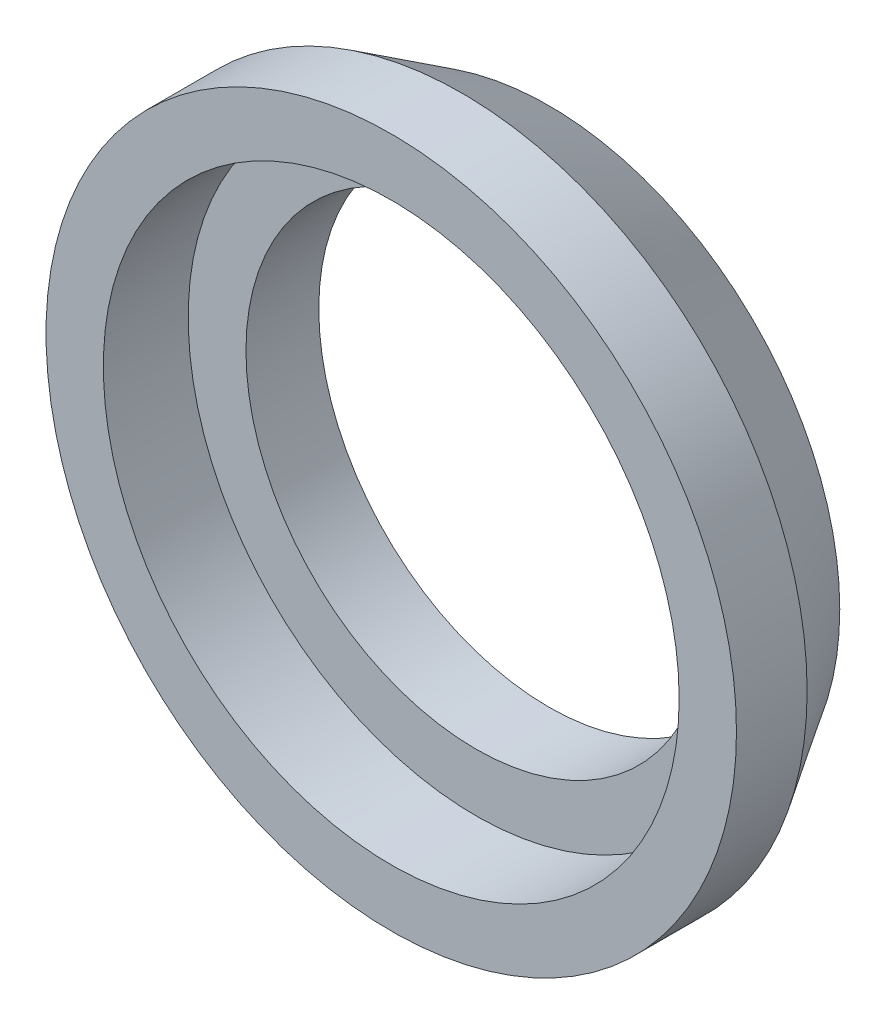
ISO-10303-21;
HEADER;
FILE_DESCRIPTION(('STEP AP214'),'2;1');
FILE_NAME('part.step','',(''),(''),'','','');
FILE_SCHEMA(('AUTOMOTIVE_DESIGN { 1 0 10303 214 1 1 1 1 }'));
ENDSEC;
DATA;
#1=APPLICATION_CONTEXT('core data for automotive mechanical design processes');
#2=APPLICATION_PROTOCOL_DEFINITION('international standard','automotive_design',2000,#1);
#3=PRODUCT_CONTEXT('',#1,'mechanical');
#4=PRODUCT('Part','Part','',(#3));
#5=PRODUCT_RELATED_PRODUCT_CATEGORY('part','',(#4));
#6=PRODUCT_DEFINITION_FORMATION('','',#4);
#7=PRODUCT_DEFINITION_CONTEXT('part definition',#1,'design');
#8=PRODUCT_DEFINITION('design','',#6,#7);
#9=PRODUCT_DEFINITION_SHAPE('','',#8);
#10=(LENGTH_UNIT() NAMED_UNIT(*) SI_UNIT(.MILLI.,.METRE.));
#11=(NAMED_UNIT(*) PLANE_ANGLE_UNIT() SI_UNIT($,.RADIAN.));
#12=(NAMED_UNIT(*) SI_UNIT($,.STERADIAN.) SOLID_ANGLE_UNIT());
#13=UNCERTAINTY_MEASURE_WITH_UNIT(LENGTH_MEASURE(1.E-05),#10,'distance_accuracy_value','');
#14=(GEOMETRIC_REPRESENTATION_CONTEXT(3) GLOBAL_UNCERTAINTY_ASSIGNED_CONTEXT((#13)) GLOBAL_UNIT_ASSIGNED_CONTEXT((#10,
#11,#12)) REPRESENTATION_CONTEXT('',''));
#15=CARTESIAN_POINT('',(0.,0.,0.));
#16=DIRECTION('',(0.,0.,1.));
#17=DIRECTION('',(1.,0.,0.));
#18=AXIS2_PLACEMENT_3D('',#15,#16,#17);
#19=CARTESIAN_POINT('',(0.,0.,4.5));
#20=DIRECTION('',(0.,0.,-1.));
#21=DIRECTION('',(-1.,0.,0.));
#22=AXIS2_PLACEMENT_3D('',#19,#20,#21);
#23=CYLINDRICAL_SURFACE('',#22,9.525);
#24=CARTESIAN_POINT('',(0.,0.,-2.09949820643843));
#25=DIRECTION('',(0.,0.,1.));
#26=DIRECTION('',(1.,0.,0.));
#27=AXIS2_PLACEMENT_3D('',#24,#25,#26);
#28=CIRCLE('',#27,9.525);
#29=CARTESIAN_POINT('',(9.525,0.,-2.09949820643843));
#30=VERTEX_POINT('',#29);
#31=EDGE_CURVE('E44',#30,#30,#28,.T.);
#32=ORIENTED_EDGE('',*,*,#31,.T.);
#33=EDGE_LOOP('',(#32));
#34=FACE_BOUND('',#33,.T.);
#35=CARTESIAN_POINT('',(0.,0.,-0.15));
#36=DIRECTION('',(0.,0.,1.));
#37=DIRECTION('',(1.,0.,0.));
#38=AXIS2_PLACEMENT_3D('',#35,#36,#37);
#39=CIRCLE('',#38,9.525);
#40=CARTESIAN_POINT('',(9.525,0.,-0.15));
#41=VERTEX_POINT('',#40);
#42=EDGE_CURVE('E64',#41,#41,#39,.T.);
#43=ORIENTED_EDGE('',*,*,#42,.F.);
#44=EDGE_LOOP('',(#43));
#45=FACE_BOUND('',#44,.T.);
#46=ADVANCED_FACE('F35',(#34,#45),#23,.T.);
#47=CARTESIAN_POINT('',(0.,0.,-2.491));
#48=DIRECTION('',(0.,0.,1.));
#49=DIRECTION('',(1.,0.,0.));
#50=AXIS2_PLACEMENT_3D('',#47,#48,#49);
#51=CYLINDRICAL_SURFACE('',#50,7.94385);
#52=CARTESIAN_POINT('',(0.,0.,-2.491));
#53=DIRECTION('',(0.,0.,1.));
#54=DIRECTION('',(1.,0.,0.));
#55=AXIS2_PLACEMENT_3D('',#52,#53,#54);
#56=CIRCLE('',#55,7.94385);
#57=CARTESIAN_POINT('',(7.94385,0.,-2.491));
#58=VERTEX_POINT('',#57);
#59=EDGE_CURVE('E58',#58,#58,#56,.T.);
#60=ORIENTED_EDGE('',*,*,#59,.F.);
#61=EDGE_LOOP('',(#60));
#62=FACE_BOUND('',#61,.T.);
#63=CARTESIAN_POINT('',(0.,0.,-0.15));
#64=DIRECTION('',(0.,0.,1.));
#65=DIRECTION('',(1.,0.,0.));
#66=AXIS2_PLACEMENT_3D('',#63,#64,#65);
#67=CIRCLE('',#66,7.94385);
#68=CARTESIAN_POINT('',(7.94385,0.,-0.15));
#69=VERTEX_POINT('',#68);
#70=EDGE_CURVE('E39',#69,#69,#67,.F.);
#71=ORIENTED_EDGE('',*,*,#70,.F.);
#72=EDGE_LOOP('',(#71));
#73=FACE_BOUND('',#72,.T.);
#74=ADVANCED_FACE('F78',(#62,#73),#51,.F.);
#75=CARTESIAN_POINT('',(0.,0.,-4.5));
#76=DIRECTION('',(0.,0.,1.));
#77=DIRECTION('',(1.,0.,0.));
#78=AXIS2_PLACEMENT_3D('',#75,#76,#77);
#79=CYLINDRICAL_SURFACE('',#78,6.35);
#80=CARTESIAN_POINT('',(0.,0.,-4.5));
#81=DIRECTION('',(0.,0.,1.));
#82=DIRECTION('',(1.,0.,0.));
#83=AXIS2_PLACEMENT_3D('',#80,#81,#82);
#84=CIRCLE('',#83,6.35);
#85=CARTESIAN_POINT('',(6.35,0.,-4.5));
#86=VERTEX_POINT('',#85);
#87=EDGE_CURVE('E52',#86,#86,#84,.T.);
#88=ORIENTED_EDGE('',*,*,#87,.F.);
#89=EDGE_LOOP('',(#88));
#90=FACE_BOUND('',#89,.T.);
#91=CARTESIAN_POINT('',(0.,0.,-2.491));
#92=DIRECTION('',(0.,0.,1.));
#93=DIRECTION('',(1.,0.,0.));
#94=AXIS2_PLACEMENT_3D('',#91,#92,#93);
#95=CIRCLE('',#94,6.35);
#96=CARTESIAN_POINT('',(6.35,0.,-2.491));
#97=VERTEX_POINT('',#96);
#98=EDGE_CURVE('E55',#97,#97,#95,.F.);
#99=ORIENTED_EDGE('',*,*,#98,.F.);
#100=EDGE_LOOP('',(#99));
#101=FACE_BOUND('',#100,.T.);
#102=ADVANCED_FACE('F80',(#90,#101),#79,.F.);
#103=CARTESIAN_POINT('',(0.,0.,-4.5));
#104=DIRECTION('',(0.,0.,1.));
#105=DIRECTION('',(1.,0.,0.));
#106=AXIS2_PLACEMENT_3D('',#103,#104,#105);
#107=PLANE('',#106);
#108=CARTESIAN_POINT('',(0.,0.,-4.5));
#109=DIRECTION('',(0.,0.,1.));
#110=DIRECTION('',(1.,0.,0.));
#111=AXIS2_PLACEMENT_3D('',#108,#109,#110);
#112=CIRCLE('',#111,8.025);
#113=CARTESIAN_POINT('',(8.025,0.,-4.5));
#114=VERTEX_POINT('',#113);
#115=EDGE_CURVE('E10',#114,#114,#112,.F.);
#116=ORIENTED_EDGE('',*,*,#115,.T.);
#117=EDGE_LOOP('',(#116));
#118=FACE_BOUND('',#117,.T.);
#119=ORIENTED_EDGE('',*,*,#87,.T.);
#120=EDGE_LOOP('',(#119));
#121=FACE_BOUND('',#120,.T.);
#122=ADVANCED_FACE('F87',(#118,#121),#107,.F.);
#123=CARTESIAN_POINT('',(0.,0.,-2.09949820643843));
#124=DIRECTION('',(0.,0.,1.));
#125=DIRECTION('',(1.,0.,0.));
#126=AXIS2_PLACEMENT_3D('',#123,#124,#125);
#127=CONICAL_SURFACE('',#126,9.525,0.558505360638187);
#128=ORIENTED_EDGE('',*,*,#115,.F.);
#129=EDGE_LOOP('',(#128));
#130=FACE_BOUND('',#129,.T.);
#131=ORIENTED_EDGE('',*,*,#31,.F.);
#132=EDGE_LOOP('',(#131));
#133=FACE_BOUND('',#132,.T.);
#134=ADVANCED_FACE('F37',(#130,#133),#127,.T.);
#135=CARTESIAN_POINT('',(0.,0.,-2.491));
#136=DIRECTION('',(0.,0.,1.));
#137=DIRECTION('',(1.,0.,0.));
#138=AXIS2_PLACEMENT_3D('',#135,#136,#137);
#139=PLANE('',#138);
#140=ORIENTED_EDGE('',*,*,#59,.T.);
#141=EDGE_LOOP('',(#140));
#142=FACE_BOUND('',#141,.T.);
#143=ORIENTED_EDGE('',*,*,#98,.T.);
#144=EDGE_LOOP('',(#143));
#145=FACE_BOUND('',#144,.T.);
#146=ADVANCED_FACE('F92',(#142,#145),#139,.T.);
#147=CARTESIAN_POINT('',(0.,0.,-0.15));
#148=DIRECTION('',(0.,0.,1.));
#149=DIRECTION('',(1.,0.,0.));
#150=AXIS2_PLACEMENT_3D('',#147,#148,#149);
#151=PLANE('',#150);
#152=ORIENTED_EDGE('',*,*,#70,.T.);
#153=EDGE_LOOP('',(#152));
#154=FACE_BOUND('',#153,.T.);
#155=ORIENTED_EDGE('',*,*,#42,.T.);
#156=EDGE_LOOP('',(#155));
#157=FACE_BOUND('',#156,.T.);
#158=ADVANCED_FACE('F76',(#154,#157),#151,.T.);
#159=CLOSED_SHELL('',(#46,#74,#102,#122,#134,#146,#158));
#160=MANIFOLD_SOLID_BREP('B2',#159);
#161=ADVANCED_BREP_SHAPE_REPRESENTATION('',(#18,#160),#14);
#162=SHAPE_DEFINITION_REPRESENTATION(#9,#161);
ENDSEC;
END-ISO-10303-21;
